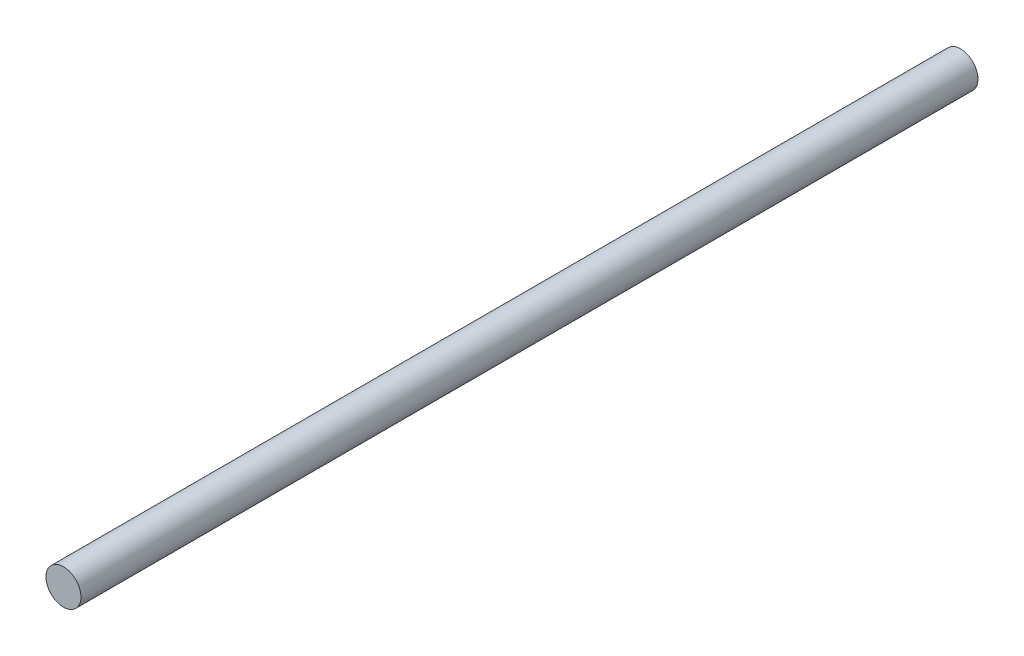
ISO-10303-21;
HEADER;
FILE_DESCRIPTION(('STEP AP214'),'2;1');
FILE_NAME('part.step','',(''),(''),'','','');
FILE_SCHEMA(('AUTOMOTIVE_DESIGN { 1 0 10303 214 1 1 1 1 }'));
ENDSEC;
DATA;
#1=APPLICATION_CONTEXT('core data for automotive mechanical design processes');
#2=APPLICATION_PROTOCOL_DEFINITION('international standard','automotive_design',2000,#1);
#3=PRODUCT_CONTEXT('',#1,'mechanical');
#4=PRODUCT('Part','Part','',(#3));
#5=PRODUCT_RELATED_PRODUCT_CATEGORY('part','',(#4));
#6=PRODUCT_DEFINITION_FORMATION('','',#4);
#7=PRODUCT_DEFINITION_CONTEXT('part definition',#1,'design');
#8=PRODUCT_DEFINITION('design','',#6,#7);
#9=PRODUCT_DEFINITION_SHAPE('','',#8);
#10=(LENGTH_UNIT() NAMED_UNIT(*) SI_UNIT(.MILLI.,.METRE.));
#11=(NAMED_UNIT(*) PLANE_ANGLE_UNIT() SI_UNIT($,.RADIAN.));
#12=(NAMED_UNIT(*) SI_UNIT($,.STERADIAN.) SOLID_ANGLE_UNIT());
#13=UNCERTAINTY_MEASURE_WITH_UNIT(LENGTH_MEASURE(1.E-05),#10,'distance_accuracy_value','');
#14=(GEOMETRIC_REPRESENTATION_CONTEXT(3) GLOBAL_UNCERTAINTY_ASSIGNED_CONTEXT((#13)) GLOBAL_UNIT_ASSIGNED_CONTEXT((#10,
#11,#12)) REPRESENTATION_CONTEXT('',''));
#15=CARTESIAN_POINT('',(0.,0.,0.));
#16=DIRECTION('',(0.,0.,1.));
#17=DIRECTION('',(1.,0.,0.));
#18=AXIS2_PLACEMENT_3D('',#15,#16,#17);
#19=CARTESIAN_POINT('',(0.,0.,102.5));
#20=DIRECTION('',(0.,0.,-1.));
#21=DIRECTION('',(-1.,0.,0.));
#22=AXIS2_PLACEMENT_3D('',#19,#20,#21);
#23=CYLINDRICAL_SURFACE('',#22,4.);
#24=CARTESIAN_POINT('',(0.,0.,102.5));
#25=DIRECTION('',(0.,0.,1.));
#26=DIRECTION('',(1.,0.,0.));
#27=AXIS2_PLACEMENT_3D('',#24,#25,#26);
#28=CIRCLE('',#27,4.);
#29=CARTESIAN_POINT('',(4.,0.,102.5));
#30=VERTEX_POINT('',#29);
#31=EDGE_CURVE('E10',#30,#30,#28,.T.);
#32=ORIENTED_EDGE('',*,*,#31,.F.);
#33=EDGE_LOOP('',(#32));
#34=FACE_BOUND('',#33,.T.);
#35=CARTESIAN_POINT('',(0.,0.,-102.5));
#36=DIRECTION('',(0.,0.,1.));
#37=DIRECTION('',(1.,0.,0.));
#38=AXIS2_PLACEMENT_3D('',#35,#36,#37);
#39=CIRCLE('',#38,4.);
#40=CARTESIAN_POINT('',(4.,0.,-102.5));
#41=VERTEX_POINT('',#40);
#42=EDGE_CURVE('E17',#41,#41,#39,.T.);
#43=ORIENTED_EDGE('',*,*,#42,.T.);
#44=EDGE_LOOP('',(#43));
#45=FACE_BOUND('',#44,.T.);
#46=ADVANCED_FACE('F14',(#34,#45),#23,.T.);
#47=CARTESIAN_POINT('',(0.,0.,102.5));
#48=DIRECTION('',(0.,0.,1.));
#49=DIRECTION('',(1.,0.,0.));
#50=AXIS2_PLACEMENT_3D('',#47,#48,#49);
#51=PLANE('',#50);
#52=ORIENTED_EDGE('',*,*,#31,.T.);
#53=EDGE_LOOP('',(#52));
#54=FACE_BOUND('',#53,.T.);
#55=ADVANCED_FACE('F29',(#54),#51,.T.);
#56=CARTESIAN_POINT('',(0.,0.,-102.5));
#57=DIRECTION('',(0.,0.,1.));
#58=DIRECTION('',(1.,0.,0.));
#59=AXIS2_PLACEMENT_3D('',#56,#57,#58);
#60=PLANE('',#59);
#61=ORIENTED_EDGE('',*,*,#42,.F.);
#62=EDGE_LOOP('',(#61));
#63=FACE_BOUND('',#62,.T.);
#64=ADVANCED_FACE('F27',(#63),#60,.F.);
#65=CLOSED_SHELL('',(#46,#55,#64));
#66=MANIFOLD_SOLID_BREP('B1',#65);
#67=ADVANCED_BREP_SHAPE_REPRESENTATION('',(#18,#66),#14);
#68=SHAPE_DEFINITION_REPRESENTATION(#9,#67);
ENDSEC;
END-ISO-10303-21;
